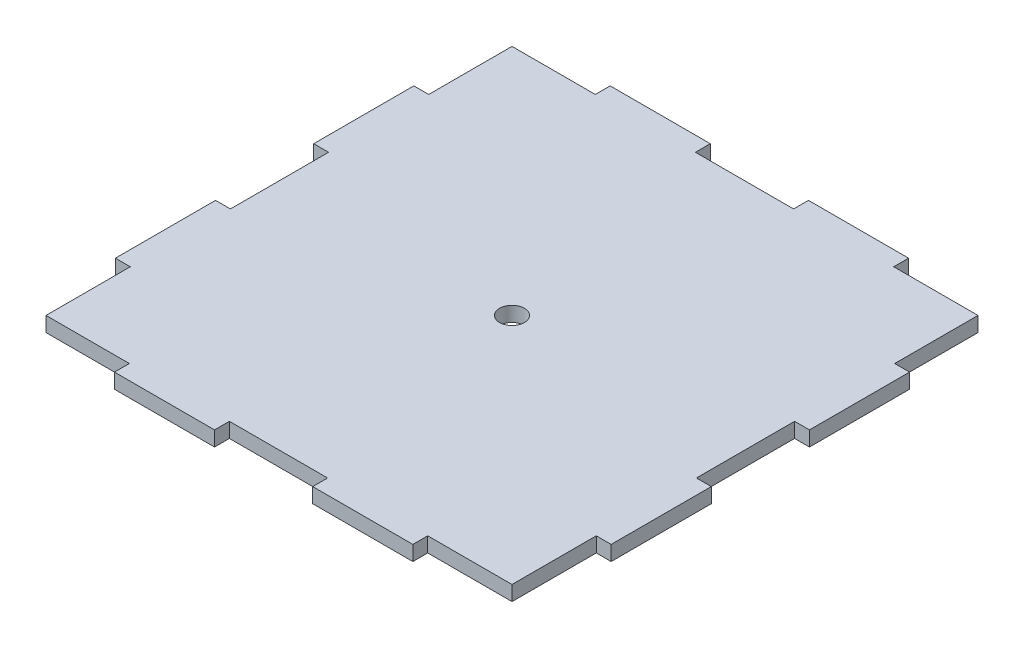
ISO-10303-21;
HEADER;
FILE_DESCRIPTION(('STEP AP214'),'2;1');
FILE_NAME('part.step','',(''),(''),'','','');
FILE_SCHEMA(('AUTOMOTIVE_DESIGN { 1 0 10303 214 1 1 1 1 }'));
ENDSEC;
DATA;
#1=APPLICATION_CONTEXT('core data for automotive mechanical design processes');
#2=APPLICATION_PROTOCOL_DEFINITION('international standard','automotive_design',2000,#1);
#3=PRODUCT_CONTEXT('',#1,'mechanical');
#4=PRODUCT('Part','Part','',(#3));
#5=PRODUCT_RELATED_PRODUCT_CATEGORY('part','',(#4));
#6=PRODUCT_DEFINITION_FORMATION('','',#4);
#7=PRODUCT_DEFINITION_CONTEXT('part definition',#1,'design');
#8=PRODUCT_DEFINITION('design','',#6,#7);
#9=PRODUCT_DEFINITION_SHAPE('','',#8);
#10=(LENGTH_UNIT() NAMED_UNIT(*) SI_UNIT(.MILLI.,.METRE.));
#11=(NAMED_UNIT(*) PLANE_ANGLE_UNIT() SI_UNIT($,.RADIAN.));
#12=(NAMED_UNIT(*) SI_UNIT($,.STERADIAN.) SOLID_ANGLE_UNIT());
#13=UNCERTAINTY_MEASURE_WITH_UNIT(LENGTH_MEASURE(1.E-05),#10,'distance_accuracy_value','');
#14=(GEOMETRIC_REPRESENTATION_CONTEXT(3) GLOBAL_UNCERTAINTY_ASSIGNED_CONTEXT((#13)) GLOBAL_UNIT_ASSIGNED_CONTEXT((#10,
#11,#12)) REPRESENTATION_CONTEXT('',''));
#15=CARTESIAN_POINT('',(0.,0.,0.));
#16=DIRECTION('',(0.,0.,1.));
#17=DIRECTION('',(1.,0.,0.));
#18=AXIS2_PLACEMENT_3D('',#15,#16,#17);
#19=CARTESIAN_POINT('',(97.0000000000006,3.,-6.79871422908079E-13));
#20=DIRECTION('',(1.,0.,0.));
#21=DIRECTION('',(0.,0.,-1.));
#22=AXIS2_PLACEMENT_3D('',#19,#20,#21);
#23=PLANE('',#22);
#24=DIRECTION('',(0.,0.,1.));
#25=VECTOR('',#24,1.);
#26=CARTESIAN_POINT('',(97.0000000000006,0.,-6.79871422908079E-13));
#27=LINE('',#26,#25);
#28=CARTESIAN_POINT('',(96.9999999999999,0.,-97.));
#29=VERTEX_POINT('',#28);
#30=CARTESIAN_POINT('',(97.,0.,-80.2000000000002));
#31=VERTEX_POINT('',#30);
#32=EDGE_CURVE('E389',#29,#31,#27,.T.);
#33=ORIENTED_EDGE('',*,*,#32,.F.);
#34=DIRECTION('',(0.,-1.,0.));
#35=VECTOR('',#34,1.);
#36=CARTESIAN_POINT('',(96.9999999999999,3.,-97.));
#37=LINE('',#36,#35);
#38=CARTESIAN_POINT('',(96.9999999999999,3.,-97.));
#39=VERTEX_POINT('',#38);
#40=EDGE_CURVE('E11',#39,#29,#37,.T.);
#41=ORIENTED_EDGE('',*,*,#40,.F.);
#42=DIRECTION('',(0.,0.,1.));
#43=VECTOR('',#42,1.);
#44=CARTESIAN_POINT('',(97.0000000000006,3.,-6.79871422908079E-13));
#45=LINE('',#44,#43);
#46=CARTESIAN_POINT('',(97.,3.,-80.2000000000002));
#47=VERTEX_POINT('',#46);
#48=EDGE_CURVE('E622',#39,#47,#45,.T.);
#49=ORIENTED_EDGE('',*,*,#48,.T.);
#50=DIRECTION('',(0.,-1.,0.));
#51=VECTOR('',#50,1.);
#52=CARTESIAN_POINT('',(97.,3.,-80.2000000000002));
#53=LINE('',#52,#51);
#54=EDGE_CURVE('E53',#47,#31,#53,.T.);
#55=ORIENTED_EDGE('',*,*,#54,.T.);
#56=EDGE_LOOP('',(#33,#41,#49,#55));
#57=FACE_BOUND('',#56,.T.);
#58=ADVANCED_FACE('F36',(#57),#23,.T.);
#59=CARTESIAN_POINT('',(0.,3.,-97.));
#60=DIRECTION('',(0.,0.,-1.));
#61=DIRECTION('',(-1.,0.,0.));
#62=AXIS2_PLACEMENT_3D('',#59,#60,#61);
#63=PLANE('',#62);
#64=DIRECTION('',(1.,0.,0.));
#65=VECTOR('',#64,1.);
#66=CARTESIAN_POINT('',(0.,0.,-97.));
#67=LINE('',#66,#65);
#68=CARTESIAN_POINT('',(79.9999999999999,0.,-97.));
#69=VERTEX_POINT('',#68);
#70=EDGE_CURVE('E383',#69,#29,#67,.T.);
#71=ORIENTED_EDGE('',*,*,#70,.F.);
#72=DIRECTION('',(0.,-1.,0.));
#73=VECTOR('',#72,1.);
#74=CARTESIAN_POINT('',(79.9999999999999,3.,-97.));
#75=LINE('',#74,#73);
#76=CARTESIAN_POINT('',(79.9999999999999,3.,-97.));
#77=VERTEX_POINT('',#76);
#78=EDGE_CURVE('E45',#77,#69,#75,.T.);
#79=ORIENTED_EDGE('',*,*,#78,.F.);
#80=DIRECTION('',(1.,0.,0.));
#81=VECTOR('',#80,1.);
#82=CARTESIAN_POINT('',(0.,3.,-97.));
#83=LINE('',#82,#81);
#84=EDGE_CURVE('E624',#77,#39,#83,.T.);
#85=ORIENTED_EDGE('',*,*,#84,.T.);
#86=ORIENTED_EDGE('',*,*,#40,.T.);
#87=EDGE_LOOP('',(#71,#79,#85,#86));
#88=FACE_BOUND('',#87,.T.);
#89=ADVANCED_FACE('F388',(#88),#63,.T.);
#90=CARTESIAN_POINT('',(79.9999999999999,3.,0.));
#91=DIRECTION('',(-1.,0.,0.));
#92=DIRECTION('',(0.,0.,1.));
#93=AXIS2_PLACEMENT_3D('',#90,#91,#92);
#94=PLANE('',#93);
#95=DIRECTION('',(0.,0.,-1.));
#96=VECTOR('',#95,1.);
#97=CARTESIAN_POINT('',(79.9999999999999,0.,0.));
#98=LINE('',#97,#96);
#99=CARTESIAN_POINT('',(79.9999999999999,0.,-100.));
#100=VERTEX_POINT('',#99);
#101=EDGE_CURVE('E373',#69,#100,#98,.T.);
#102=ORIENTED_EDGE('',*,*,#101,.T.);
#103=DIRECTION('',(0.,-1.,0.));
#104=VECTOR('',#103,1.);
#105=CARTESIAN_POINT('',(79.9999999999999,3.,-100.));
#106=LINE('',#105,#104);
#107=CARTESIAN_POINT('',(79.9999999999999,3.,-100.));
#108=VERTEX_POINT('',#107);
#109=EDGE_CURVE('E366',#108,#100,#106,.T.);
#110=ORIENTED_EDGE('',*,*,#109,.F.);
#111=DIRECTION('',(0.,0.,-1.));
#112=VECTOR('',#111,1.);
#113=CARTESIAN_POINT('',(79.9999999999999,3.,0.));
#114=LINE('',#113,#112);
#115=EDGE_CURVE('E375',#77,#108,#114,.T.);
#116=ORIENTED_EDGE('',*,*,#115,.F.);
#117=ORIENTED_EDGE('',*,*,#78,.T.);
#118=EDGE_LOOP('',(#102,#110,#116,#117));
#119=FACE_BOUND('',#118,.T.);
#120=ADVANCED_FACE('F371',(#119),#94,.F.);
#121=CARTESIAN_POINT('',(0.,3.,-100.));
#122=DIRECTION('',(0.,0.,-1.));
#123=DIRECTION('',(-1.,0.,0.));
#124=AXIS2_PLACEMENT_3D('',#121,#122,#123);
#125=PLANE('',#124);
#126=DIRECTION('',(1.,0.,0.));
#127=VECTOR('',#126,1.);
#128=CARTESIAN_POINT('',(0.,0.,-100.));
#129=LINE('',#128,#127);
#130=CARTESIAN_POINT('',(59.8,0.,-100.));
#131=VERTEX_POINT('',#130);
#132=EDGE_CURVE('E386',#131,#100,#129,.T.);
#133=ORIENTED_EDGE('',*,*,#132,.F.);
#134=DIRECTION('',(0.,-1.,0.));
#135=VECTOR('',#134,1.);
#136=CARTESIAN_POINT('',(59.8,3.,-100.));
#137=LINE('',#136,#135);
#138=CARTESIAN_POINT('',(59.8,3.,-100.));
#139=VERTEX_POINT('',#138);
#140=EDGE_CURVE('E364',#139,#131,#137,.T.);
#141=ORIENTED_EDGE('',*,*,#140,.F.);
#142=DIRECTION('',(1.,0.,0.));
#143=VECTOR('',#142,1.);
#144=CARTESIAN_POINT('',(0.,3.,-100.));
#145=LINE('',#144,#143);
#146=EDGE_CURVE('E629',#139,#108,#145,.T.);
#147=ORIENTED_EDGE('',*,*,#146,.T.);
#148=ORIENTED_EDGE('',*,*,#109,.T.);
#149=EDGE_LOOP('',(#133,#141,#147,#148));
#150=FACE_BOUND('',#149,.T.);
#151=ADVANCED_FACE('F506',(#150),#125,.T.);
#152=CARTESIAN_POINT('',(59.7999999999981,3.,1.1065222812097E-12));
#153=DIRECTION('',(-1.,0.,0.));
#154=DIRECTION('',(0.,0.,1.));
#155=AXIS2_PLACEMENT_3D('',#152,#153,#154);
#156=PLANE('',#155);
#157=DIRECTION('',(0.,0.,-1.));
#158=VECTOR('',#157,1.);
#159=CARTESIAN_POINT('',(59.7999999999981,0.,1.1065222812097E-12));
#160=LINE('',#159,#158);
#161=CARTESIAN_POINT('',(59.7999999999999,0.,-97.));
#162=VERTEX_POINT('',#161);
#163=EDGE_CURVE('E396',#162,#131,#160,.T.);
#164=ORIENTED_EDGE('',*,*,#163,.F.);
#165=DIRECTION('',(0.,-1.,0.));
#166=VECTOR('',#165,1.);
#167=CARTESIAN_POINT('',(59.7999999999999,3.,-97.));
#168=LINE('',#167,#166);
#169=CARTESIAN_POINT('',(59.7999999999999,3.,-97.));
#170=VERTEX_POINT('',#169);
#171=EDGE_CURVE('E362',#170,#162,#168,.T.);
#172=ORIENTED_EDGE('',*,*,#171,.F.);
#173=DIRECTION('',(0.,0.,-1.));
#174=VECTOR('',#173,1.);
#175=CARTESIAN_POINT('',(59.7999999999981,3.,1.1065222812097E-12));
#176=LINE('',#175,#174);
#177=EDGE_CURVE('E632',#170,#139,#176,.T.);
#178=ORIENTED_EDGE('',*,*,#177,.T.);
#179=ORIENTED_EDGE('',*,*,#140,.T.);
#180=EDGE_LOOP('',(#164,#172,#178,#179));
#181=FACE_BOUND('',#180,.T.);
#182=ADVANCED_FACE('F507',(#181),#156,.T.);
#183=CARTESIAN_POINT('',(0.,3.,-97.));
#184=DIRECTION('',(0.,0.,-1.));
#185=DIRECTION('',(-1.,0.,0.));
#186=AXIS2_PLACEMENT_3D('',#183,#184,#185);
#187=PLANE('',#186);
#188=DIRECTION('',(1.,0.,0.));
#189=VECTOR('',#188,1.);
#190=CARTESIAN_POINT('',(0.,0.,-97.));
#191=LINE('',#190,#189);
#192=CARTESIAN_POINT('',(39.9999999999999,0.,-97.));
#193=VERTEX_POINT('',#192);
#194=EDGE_CURVE('E399',#193,#162,#191,.T.);
#195=ORIENTED_EDGE('',*,*,#194,.F.);
#196=DIRECTION('',(0.,-1.,0.));
#197=VECTOR('',#196,1.);
#198=CARTESIAN_POINT('',(39.9999999999999,3.,-97.));
#199=LINE('',#198,#197);
#200=CARTESIAN_POINT('',(39.9999999999999,3.,-97.));
#201=VERTEX_POINT('',#200);
#202=EDGE_CURVE('E360',#201,#193,#199,.T.);
#203=ORIENTED_EDGE('',*,*,#202,.F.);
#204=DIRECTION('',(1.,0.,0.));
#205=VECTOR('',#204,1.);
#206=CARTESIAN_POINT('',(0.,3.,-97.));
#207=LINE('',#206,#205);
#208=EDGE_CURVE('E636',#201,#170,#207,.T.);
#209=ORIENTED_EDGE('',*,*,#208,.T.);
#210=ORIENTED_EDGE('',*,*,#171,.T.);
#211=EDGE_LOOP('',(#195,#203,#209,#210));
#212=FACE_BOUND('',#211,.T.);
#213=ADVANCED_FACE('F510',(#212),#187,.T.);
#214=CARTESIAN_POINT('',(39.9999999999999,3.,0.));
#215=DIRECTION('',(-1.,0.,0.));
#216=DIRECTION('',(0.,0.,1.));
#217=AXIS2_PLACEMENT_3D('',#214,#215,#216);
#218=PLANE('',#217);
#219=DIRECTION('',(0.,0.,-1.));
#220=VECTOR('',#219,1.);
#221=CARTESIAN_POINT('',(39.9999999999999,0.,0.));
#222=LINE('',#221,#220);
#223=CARTESIAN_POINT('',(39.9999999999999,0.,-100.));
#224=VERTEX_POINT('',#223);
#225=EDGE_CURVE('E402',#193,#224,#222,.T.);
#226=ORIENTED_EDGE('',*,*,#225,.T.);
#227=DIRECTION('',(0.,-1.,0.));
#228=VECTOR('',#227,1.);
#229=CARTESIAN_POINT('',(39.9999999999999,3.,-100.));
#230=LINE('',#229,#228);
#231=CARTESIAN_POINT('',(39.9999999999999,3.,-100.));
#232=VERTEX_POINT('',#231);
#233=EDGE_CURVE('E358',#232,#224,#230,.T.);
#234=ORIENTED_EDGE('',*,*,#233,.F.);
#235=DIRECTION('',(0.,0.,-1.));
#236=VECTOR('',#235,1.);
#237=CARTESIAN_POINT('',(39.9999999999999,3.,0.));
#238=LINE('',#237,#236);
#239=EDGE_CURVE('E639',#201,#232,#238,.T.);
#240=ORIENTED_EDGE('',*,*,#239,.F.);
#241=ORIENTED_EDGE('',*,*,#202,.T.);
#242=EDGE_LOOP('',(#226,#234,#240,#241));
#243=FACE_BOUND('',#242,.T.);
#244=ADVANCED_FACE('F514',(#243),#218,.F.);
#245=CARTESIAN_POINT('',(19.8,0.,-100.));
#246=VERTEX_POINT('',#245);
#247=EDGE_CURVE('E397',#246,#224,#129,.T.);
#248=ORIENTED_EDGE('',*,*,#247,.F.);
#249=DIRECTION('',(0.,-1.,0.));
#250=VECTOR('',#249,1.);
#251=CARTESIAN_POINT('',(19.8,3.,-100.));
#252=LINE('',#251,#250);
#253=CARTESIAN_POINT('',(19.8,3.,-100.));
#254=VERTEX_POINT('',#253);
#255=EDGE_CURVE('E356',#254,#246,#252,.T.);
#256=ORIENTED_EDGE('',*,*,#255,.F.);
#257=EDGE_CURVE('E633',#254,#232,#145,.T.);
#258=ORIENTED_EDGE('',*,*,#257,.T.);
#259=ORIENTED_EDGE('',*,*,#233,.T.);
#260=EDGE_LOOP('',(#248,#256,#258,#259));
#261=FACE_BOUND('',#260,.T.);
#262=ADVANCED_FACE('F518',(#261),#125,.T.);
#263=CARTESIAN_POINT('',(19.7999999999982,3.,3.66373598126267E-13));
#264=DIRECTION('',(-1.,0.,0.));
#265=DIRECTION('',(0.,0.,1.));
#266=AXIS2_PLACEMENT_3D('',#263,#264,#265);
#267=PLANE('',#266);
#268=DIRECTION('',(0.,0.,-1.));
#269=VECTOR('',#268,1.);
#270=CARTESIAN_POINT('',(19.7999999999982,0.,3.66373598126267E-13));
#271=LINE('',#270,#269);
#272=CARTESIAN_POINT('',(19.7999999999999,0.,-97.));
#273=VERTEX_POINT('',#272);
#274=EDGE_CURVE('E405',#273,#246,#271,.T.);
#275=ORIENTED_EDGE('',*,*,#274,.F.);
#276=DIRECTION('',(0.,-1.,0.));
#277=VECTOR('',#276,1.);
#278=CARTESIAN_POINT('',(19.7999999999999,3.,-97.));
#279=LINE('',#278,#277);
#280=CARTESIAN_POINT('',(19.7999999999999,3.,-97.));
#281=VERTEX_POINT('',#280);
#282=EDGE_CURVE('E354',#281,#273,#279,.T.);
#283=ORIENTED_EDGE('',*,*,#282,.F.);
#284=DIRECTION('',(0.,0.,-1.));
#285=VECTOR('',#284,1.);
#286=CARTESIAN_POINT('',(19.7999999999982,3.,3.66373598126267E-13));
#287=LINE('',#286,#285);
#288=EDGE_CURVE('E641',#281,#254,#287,.T.);
#289=ORIENTED_EDGE('',*,*,#288,.T.);
#290=ORIENTED_EDGE('',*,*,#255,.T.);
#291=EDGE_LOOP('',(#275,#283,#289,#290));
#292=FACE_BOUND('',#291,.T.);
#293=ADVANCED_FACE('F522',(#292),#267,.T.);
#294=CARTESIAN_POINT('',(0.,3.,-97.));
#295=DIRECTION('',(0.,0.,-1.));
#296=DIRECTION('',(-1.,0.,0.));
#297=AXIS2_PLACEMENT_3D('',#294,#295,#296);
#298=PLANE('',#297);
#299=DIRECTION('',(1.,0.,0.));
#300=VECTOR('',#299,1.);
#301=CARTESIAN_POINT('',(0.,0.,-97.));
#302=LINE('',#301,#300);
#303=CARTESIAN_POINT('',(3.,0.,-97.));
#304=VERTEX_POINT('',#303);
#305=EDGE_CURVE('E408',#304,#273,#302,.T.);
#306=ORIENTED_EDGE('',*,*,#305,.F.);
#307=DIRECTION('',(0.,-1.,0.));
#308=VECTOR('',#307,1.);
#309=CARTESIAN_POINT('',(3.,3.,-97.));
#310=LINE('',#309,#308);
#311=CARTESIAN_POINT('',(3.,3.,-97.));
#312=VERTEX_POINT('',#311);
#313=EDGE_CURVE('E352',#312,#304,#310,.T.);
#314=ORIENTED_EDGE('',*,*,#313,.F.);
#315=DIRECTION('',(1.,0.,0.));
#316=VECTOR('',#315,1.);
#317=CARTESIAN_POINT('',(0.,3.,-97.));
#318=LINE('',#317,#316);
#319=EDGE_CURVE('E644',#312,#281,#318,.T.);
#320=ORIENTED_EDGE('',*,*,#319,.T.);
#321=ORIENTED_EDGE('',*,*,#282,.T.);
#322=EDGE_LOOP('',(#306,#314,#320,#321));
#323=FACE_BOUND('',#322,.T.);
#324=ADVANCED_FACE('F526',(#323),#298,.T.);
#325=CARTESIAN_POINT('',(3.00000000000001,3.,0.));
#326=DIRECTION('',(1.,0.,0.));
#327=DIRECTION('',(0.,0.,-1.));
#328=AXIS2_PLACEMENT_3D('',#325,#326,#327);
#329=PLANE('',#328);
#330=DIRECTION('',(0.,0.,1.));
#331=VECTOR('',#330,1.);
#332=CARTESIAN_POINT('',(3.00000000000001,0.,0.));
#333=LINE('',#332,#331);
#334=CARTESIAN_POINT('',(3.,0.,-80.2));
#335=VERTEX_POINT('',#334);
#336=EDGE_CURVE('E411',#304,#335,#333,.T.);
#337=ORIENTED_EDGE('',*,*,#336,.T.);
#338=DIRECTION('',(0.,-1.,0.));
#339=VECTOR('',#338,1.);
#340=CARTESIAN_POINT('',(3.,3.,-80.2));
#341=LINE('',#340,#339);
#342=CARTESIAN_POINT('',(3.,3.,-80.2));
#343=VERTEX_POINT('',#342);
#344=EDGE_CURVE('E349',#343,#335,#341,.T.);
#345=ORIENTED_EDGE('',*,*,#344,.F.);
#346=DIRECTION('',(0.,0.,1.));
#347=VECTOR('',#346,1.);
#348=CARTESIAN_POINT('',(3.00000000000001,3.,0.));
#349=LINE('',#348,#347);
#350=EDGE_CURVE('E647',#312,#343,#349,.T.);
#351=ORIENTED_EDGE('',*,*,#350,.F.);
#352=ORIENTED_EDGE('',*,*,#313,.T.);
#353=EDGE_LOOP('',(#337,#345,#351,#352));
#354=FACE_BOUND('',#353,.T.);
#355=ADVANCED_FACE('F530',(#354),#329,.F.);
#356=CARTESIAN_POINT('',(0.,3.,-80.2));
#357=DIRECTION('',(0.,0.,1.));
#358=DIRECTION('',(1.,0.,0.));
#359=AXIS2_PLACEMENT_3D('',#356,#357,#358);
#360=PLANE('',#359);
#361=DIRECTION('',(-1.,0.,0.));
#362=VECTOR('',#361,1.);
#363=CARTESIAN_POINT('',(0.,0.,-80.2));
#364=LINE('',#363,#362);
#365=CARTESIAN_POINT('',(0.,0.,-80.2));
#366=VERTEX_POINT('',#365);
#367=EDGE_CURVE('E414',#335,#366,#364,.T.);
#368=ORIENTED_EDGE('',*,*,#367,.T.);
#369=DIRECTION('',(0.,-1.,0.));
#370=VECTOR('',#369,1.);
#371=CARTESIAN_POINT('',(0.,3.,-80.2));
#372=LINE('',#371,#370);
#373=CARTESIAN_POINT('',(0.,3.,-80.2));
#374=VERTEX_POINT('',#373);
#375=EDGE_CURVE('E347',#374,#366,#372,.T.);
#376=ORIENTED_EDGE('',*,*,#375,.F.);
#377=DIRECTION('',(-1.,0.,0.));
#378=VECTOR('',#377,1.);
#379=CARTESIAN_POINT('',(0.,3.,-80.2));
#380=LINE('',#379,#378);
#381=EDGE_CURVE('E650',#343,#374,#380,.T.);
#382=ORIENTED_EDGE('',*,*,#381,.F.);
#383=ORIENTED_EDGE('',*,*,#344,.T.);
#384=EDGE_LOOP('',(#368,#376,#382,#383));
#385=FACE_BOUND('',#384,.T.);
#386=ADVANCED_FACE('F534',(#385),#360,.F.);
#387=CARTESIAN_POINT('',(0.,3.,0.));
#388=DIRECTION('',(-1.,0.,0.));
#389=DIRECTION('',(0.,0.,1.));
#390=AXIS2_PLACEMENT_3D('',#387,#388,#389);
#391=PLANE('',#390);
#392=DIRECTION('',(0.,0.,-1.));
#393=VECTOR('',#392,1.);
#394=CARTESIAN_POINT('',(0.,0.,0.));
#395=LINE('',#394,#393);
#396=CARTESIAN_POINT('',(0.,0.,-60.));
#397=VERTEX_POINT('',#396);
#398=EDGE_CURVE('E417',#397,#366,#395,.T.);
#399=ORIENTED_EDGE('',*,*,#398,.F.);
#400=DIRECTION('',(0.,-1.,0.));
#401=VECTOR('',#400,1.);
#402=CARTESIAN_POINT('',(0.,3.,-60.));
#403=LINE('',#402,#401);
#404=CARTESIAN_POINT('',(0.,3.,-60.));
#405=VERTEX_POINT('',#404);
#406=EDGE_CURVE('E345',#405,#397,#403,.T.);
#407=ORIENTED_EDGE('',*,*,#406,.F.);
#408=DIRECTION('',(0.,0.,-1.));
#409=VECTOR('',#408,1.);
#410=CARTESIAN_POINT('',(0.,3.,0.));
#411=LINE('',#410,#409);
#412=EDGE_CURVE('E652',#405,#374,#411,.T.);
#413=ORIENTED_EDGE('',*,*,#412,.T.);
#414=ORIENTED_EDGE('',*,*,#375,.T.);
#415=EDGE_LOOP('',(#399,#407,#413,#414));
#416=FACE_BOUND('',#415,.T.);
#417=ADVANCED_FACE('F538',(#416),#391,.T.);
#418=CARTESIAN_POINT('',(0.,3.,-60.));
#419=DIRECTION('',(0.,0.,1.));
#420=DIRECTION('',(1.,0.,0.));
#421=AXIS2_PLACEMENT_3D('',#418,#419,#420);
#422=PLANE('',#421);
#423=DIRECTION('',(-1.,0.,0.));
#424=VECTOR('',#423,1.);
#425=CARTESIAN_POINT('',(0.,0.,-60.));
#426=LINE('',#425,#424);
#427=CARTESIAN_POINT('',(3.00000000000042,0.,-60.));
#428=VERTEX_POINT('',#427);
#429=EDGE_CURVE('E420',#428,#397,#426,.T.);
#430=ORIENTED_EDGE('',*,*,#429,.F.);
#431=DIRECTION('',(0.,-1.,0.));
#432=VECTOR('',#431,1.);
#433=CARTESIAN_POINT('',(3.00000000000042,3.,-60.));
#434=LINE('',#433,#432);
#435=CARTESIAN_POINT('',(3.00000000000042,3.,-60.));
#436=VERTEX_POINT('',#435);
#437=EDGE_CURVE('E343',#436,#428,#434,.T.);
#438=ORIENTED_EDGE('',*,*,#437,.F.);
#439=DIRECTION('',(-1.,0.,0.));
#440=VECTOR('',#439,1.);
#441=CARTESIAN_POINT('',(0.,3.,-60.));
#442=LINE('',#441,#440);
#443=EDGE_CURVE('E655',#436,#405,#442,.T.);
#444=ORIENTED_EDGE('',*,*,#443,.T.);
#445=ORIENTED_EDGE('',*,*,#406,.T.);
#446=EDGE_LOOP('',(#430,#438,#444,#445));
#447=FACE_BOUND('',#446,.T.);
#448=ADVANCED_FACE('F540',(#447),#422,.T.);
#449=CARTESIAN_POINT('',(3.00000000000043,3.,0.));
#450=DIRECTION('',(1.,0.,0.));
#451=DIRECTION('',(0.,0.,-1.));
#452=AXIS2_PLACEMENT_3D('',#449,#450,#451);
#453=PLANE('',#452);
#454=DIRECTION('',(0.,0.,1.));
#455=VECTOR('',#454,1.);
#456=CARTESIAN_POINT('',(3.00000000000043,0.,0.));
#457=LINE('',#456,#455);
#458=CARTESIAN_POINT('',(3.00000000000042,0.,-40.2));
#459=VERTEX_POINT('',#458);
#460=EDGE_CURVE('E424',#428,#459,#457,.T.);
#461=ORIENTED_EDGE('',*,*,#460,.T.);
#462=DIRECTION('',(0.,-1.,0.));
#463=VECTOR('',#462,1.);
#464=CARTESIAN_POINT('',(3.00000000000042,3.,-40.2));
#465=LINE('',#464,#463);
#466=CARTESIAN_POINT('',(3.00000000000042,3.,-40.2));
#467=VERTEX_POINT('',#466);
#468=EDGE_CURVE('E340',#467,#459,#465,.T.);
#469=ORIENTED_EDGE('',*,*,#468,.F.);
#470=DIRECTION('',(0.,0.,1.));
#471=VECTOR('',#470,1.);
#472=CARTESIAN_POINT('',(3.00000000000043,3.,0.));
#473=LINE('',#472,#471);
#474=EDGE_CURVE('E659',#436,#467,#473,.T.);
#475=ORIENTED_EDGE('',*,*,#474,.F.);
#476=ORIENTED_EDGE('',*,*,#437,.T.);
#477=EDGE_LOOP('',(#461,#469,#475,#476));
#478=FACE_BOUND('',#477,.T.);
#479=ADVANCED_FACE('F543',(#478),#453,.F.);
#480=CARTESIAN_POINT('',(0.,3.,-40.2));
#481=DIRECTION('',(0.,0.,1.));
#482=DIRECTION('',(1.,0.,0.));
#483=AXIS2_PLACEMENT_3D('',#480,#481,#482);
#484=PLANE('',#483);
#485=DIRECTION('',(-1.,0.,0.));
#486=VECTOR('',#485,1.);
#487=CARTESIAN_POINT('',(0.,0.,-40.2));
#488=LINE('',#487,#486);
#489=CARTESIAN_POINT('',(0.,0.,-40.2));
#490=VERTEX_POINT('',#489);
#491=EDGE_CURVE('E427',#459,#490,#488,.T.);
#492=ORIENTED_EDGE('',*,*,#491,.T.);
#493=DIRECTION('',(0.,-1.,0.));
#494=VECTOR('',#493,1.);
#495=CARTESIAN_POINT('',(0.,3.,-40.2));
#496=LINE('',#495,#494);
#497=CARTESIAN_POINT('',(0.,3.,-40.2));
#498=VERTEX_POINT('',#497);
#499=EDGE_CURVE('E338',#498,#490,#496,.T.);
#500=ORIENTED_EDGE('',*,*,#499,.F.);
#501=DIRECTION('',(-1.,0.,0.));
#502=VECTOR('',#501,1.);
#503=CARTESIAN_POINT('',(0.,3.,-40.2));
#504=LINE('',#503,#502);
#505=EDGE_CURVE('E662',#467,#498,#504,.T.);
#506=ORIENTED_EDGE('',*,*,#505,.F.);
#507=ORIENTED_EDGE('',*,*,#468,.T.);
#508=EDGE_LOOP('',(#492,#500,#506,#507));
#509=FACE_BOUND('',#508,.T.);
#510=ADVANCED_FACE('F547',(#509),#484,.F.);
#511=CARTESIAN_POINT('',(0.,0.,-20.));
#512=VERTEX_POINT('',#511);
#513=EDGE_CURVE('E421',#512,#490,#395,.T.);
#514=ORIENTED_EDGE('',*,*,#513,.F.);
#515=DIRECTION('',(0.,-1.,0.));
#516=VECTOR('',#515,1.);
#517=CARTESIAN_POINT('',(0.,3.,-20.));
#518=LINE('',#517,#516);
#519=CARTESIAN_POINT('',(0.,3.,-20.));
#520=VERTEX_POINT('',#519);
#521=EDGE_CURVE('E336',#520,#512,#518,.T.);
#522=ORIENTED_EDGE('',*,*,#521,.F.);
#523=EDGE_CURVE('E656',#520,#498,#411,.T.);
#524=ORIENTED_EDGE('',*,*,#523,.T.);
#525=ORIENTED_EDGE('',*,*,#499,.T.);
#526=EDGE_LOOP('',(#514,#522,#524,#525));
#527=FACE_BOUND('',#526,.T.);
#528=ADVANCED_FACE('F551',(#527),#391,.T.);
#529=CARTESIAN_POINT('',(0.,3.,-20.));
#530=DIRECTION('',(0.,0.,1.));
#531=DIRECTION('',(1.,0.,0.));
#532=AXIS2_PLACEMENT_3D('',#529,#530,#531);
#533=PLANE('',#532);
#534=DIRECTION('',(-1.,0.,0.));
#535=VECTOR('',#534,1.);
#536=CARTESIAN_POINT('',(0.,0.,-20.));
#537=LINE('',#536,#535);
#538=CARTESIAN_POINT('',(3.00000000000084,0.,-20.));
#539=VERTEX_POINT('',#538);
#540=EDGE_CURVE('E430',#539,#512,#537,.T.);
#541=ORIENTED_EDGE('',*,*,#540,.F.);
#542=DIRECTION('',(0.,-1.,0.));
#543=VECTOR('',#542,1.);
#544=CARTESIAN_POINT('',(3.00000000000084,3.,-20.));
#545=LINE('',#544,#543);
#546=CARTESIAN_POINT('',(3.00000000000084,3.,-20.));
#547=VERTEX_POINT('',#546);
#548=EDGE_CURVE('E334',#547,#539,#545,.T.);
#549=ORIENTED_EDGE('',*,*,#548,.F.);
#550=DIRECTION('',(-1.,0.,0.));
#551=VECTOR('',#550,1.);
#552=CARTESIAN_POINT('',(0.,3.,-20.));
#553=LINE('',#552,#551);
#554=EDGE_CURVE('E664',#547,#520,#553,.T.);
#555=ORIENTED_EDGE('',*,*,#554,.T.);
#556=ORIENTED_EDGE('',*,*,#521,.T.);
#557=EDGE_LOOP('',(#541,#549,#555,#556));
#558=FACE_BOUND('',#557,.T.);
#559=ADVANCED_FACE('F555',(#558),#533,.T.);
#560=CARTESIAN_POINT('',(3.00000000000084,3.,0.));
#561=DIRECTION('',(1.,0.,0.));
#562=DIRECTION('',(0.,0.,-1.));
#563=AXIS2_PLACEMENT_3D('',#560,#561,#562);
#564=PLANE('',#563);
#565=DIRECTION('',(0.,0.,1.));
#566=VECTOR('',#565,1.);
#567=CARTESIAN_POINT('',(3.00000000000084,0.,0.));
#568=LINE('',#567,#566);
#569=CARTESIAN_POINT('',(3.00000000000084,0.,-3.));
#570=VERTEX_POINT('',#569);
#571=EDGE_CURVE('E433',#539,#570,#568,.T.);
#572=ORIENTED_EDGE('',*,*,#571,.T.);
#573=DIRECTION('',(0.,-1.,0.));
#574=VECTOR('',#573,1.);
#575=CARTESIAN_POINT('',(3.00000000000084,3.,-3.));
#576=LINE('',#575,#574);
#577=CARTESIAN_POINT('',(3.00000000000084,3.,-3.));
#578=VERTEX_POINT('',#577);
#579=EDGE_CURVE('E331',#578,#570,#576,.T.);
#580=ORIENTED_EDGE('',*,*,#579,.F.);
#581=DIRECTION('',(0.,0.,1.));
#582=VECTOR('',#581,1.);
#583=CARTESIAN_POINT('',(3.00000000000084,3.,0.));
#584=LINE('',#583,#582);
#585=EDGE_CURVE('E667',#547,#578,#584,.T.);
#586=ORIENTED_EDGE('',*,*,#585,.F.);
#587=ORIENTED_EDGE('',*,*,#548,.T.);
#588=EDGE_LOOP('',(#572,#580,#586,#587));
#589=FACE_BOUND('',#588,.T.);
#590=ADVANCED_FACE('F559',(#589),#564,.F.);
#591=CARTESIAN_POINT('',(0.,3.,-3.));
#592=DIRECTION('',(0.,0.,-1.));
#593=DIRECTION('',(-1.,0.,0.));
#594=AXIS2_PLACEMENT_3D('',#591,#592,#593);
#595=PLANE('',#594);
#596=DIRECTION('',(1.,0.,0.));
#597=VECTOR('',#596,1.);
#598=CARTESIAN_POINT('',(0.,0.,-3.));
#599=LINE('',#598,#597);
#600=CARTESIAN_POINT('',(19.7999999999999,0.,-3.));
#601=VERTEX_POINT('',#600);
#602=EDGE_CURVE('E436',#570,#601,#599,.T.);
#603=ORIENTED_EDGE('',*,*,#602,.T.);
#604=DIRECTION('',(0.,-1.,0.));
#605=VECTOR('',#604,1.);
#606=CARTESIAN_POINT('',(19.7999999999999,3.,-3.));
#607=LINE('',#606,#605);
#608=CARTESIAN_POINT('',(19.7999999999999,3.,-3.));
#609=VERTEX_POINT('',#608);
#610=EDGE_CURVE('E328',#609,#601,#607,.T.);
#611=ORIENTED_EDGE('',*,*,#610,.F.);
#612=DIRECTION('',(1.,0.,0.));
#613=VECTOR('',#612,1.);
#614=CARTESIAN_POINT('',(0.,3.,-3.));
#615=LINE('',#614,#613);
#616=EDGE_CURVE('E670',#578,#609,#615,.T.);
#617=ORIENTED_EDGE('',*,*,#616,.F.);
#618=ORIENTED_EDGE('',*,*,#579,.T.);
#619=EDGE_LOOP('',(#603,#611,#617,#618));
#620=FACE_BOUND('',#619,.T.);
#621=ADVANCED_FACE('F563',(#620),#595,.F.);
#622=CARTESIAN_POINT('',(19.8,3.,-3.66373598126301E-13));
#623=DIRECTION('',(1.,0.,0.));
#624=DIRECTION('',(0.,0.,-1.));
#625=AXIS2_PLACEMENT_3D('',#622,#623,#624);
#626=PLANE('',#625);
#627=DIRECTION('',(0.,0.,1.));
#628=VECTOR('',#627,1.);
#629=CARTESIAN_POINT('',(19.8,0.,-3.66373598126301E-13));
#630=LINE('',#629,#628);
#631=CARTESIAN_POINT('',(19.8,0.,0.));
#632=VERTEX_POINT('',#631);
#633=EDGE_CURVE('E439',#601,#632,#630,.T.);
#634=ORIENTED_EDGE('',*,*,#633,.T.);
#635=DIRECTION('',(0.,-1.,0.));
#636=VECTOR('',#635,1.);
#637=CARTESIAN_POINT('',(19.8,3.,0.));
#638=LINE('',#637,#636);
#639=CARTESIAN_POINT('',(19.8,3.,0.));
#640=VERTEX_POINT('',#639);
#641=EDGE_CURVE('E325',#640,#632,#638,.T.);
#642=ORIENTED_EDGE('',*,*,#641,.F.);
#643=DIRECTION('',(0.,0.,1.));
#644=VECTOR('',#643,1.);
#645=CARTESIAN_POINT('',(19.8,3.,-3.66373598126301E-13));
#646=LINE('',#645,#644);
#647=EDGE_CURVE('E673',#609,#640,#646,.T.);
#648=ORIENTED_EDGE('',*,*,#647,.F.);
#649=ORIENTED_EDGE('',*,*,#610,.T.);
#650=EDGE_LOOP('',(#634,#642,#648,#649));
#651=FACE_BOUND('',#650,.T.);
#652=ADVANCED_FACE('F567',(#651),#626,.F.);
#653=CARTESIAN_POINT('',(0.,3.,0.));
#654=DIRECTION('',(0.,0.,-1.));
#655=DIRECTION('',(-1.,0.,0.));
#656=AXIS2_PLACEMENT_3D('',#653,#654,#655);
#657=PLANE('',#656);
#658=DIRECTION('',(1.,0.,0.));
#659=VECTOR('',#658,1.);
#660=CARTESIAN_POINT('',(0.,0.,0.));
#661=LINE('',#660,#659);
#662=CARTESIAN_POINT('',(39.9999999999999,0.,0.));
#663=VERTEX_POINT('',#662);
#664=EDGE_CURVE('E442',#632,#663,#661,.T.);
#665=ORIENTED_EDGE('',*,*,#664,.T.);
#666=DIRECTION('',(0.,-1.,0.));
#667=VECTOR('',#666,1.);
#668=CARTESIAN_POINT('',(39.9999999999999,3.,0.));
#669=LINE('',#668,#667);
#670=CARTESIAN_POINT('',(39.9999999999999,3.,0.));
#671=VERTEX_POINT('',#670);
#672=EDGE_CURVE('E323',#671,#663,#669,.T.);
#673=ORIENTED_EDGE('',*,*,#672,.F.);
#674=DIRECTION('',(1.,0.,0.));
#675=VECTOR('',#674,1.);
#676=CARTESIAN_POINT('',(0.,3.,0.));
#677=LINE('',#676,#675);
#678=EDGE_CURVE('E676',#640,#671,#677,.T.);
#679=ORIENTED_EDGE('',*,*,#678,.F.);
#680=ORIENTED_EDGE('',*,*,#641,.T.);
#681=EDGE_LOOP('',(#665,#673,#679,#680));
#682=FACE_BOUND('',#681,.T.);
#683=ADVANCED_FACE('F571',(#682),#657,.F.);
#684=CARTESIAN_POINT('',(39.9999999999999,3.,0.));
#685=DIRECTION('',(1.,0.,0.));
#686=DIRECTION('',(0.,0.,-1.));
#687=AXIS2_PLACEMENT_3D('',#684,#685,#686);
#688=PLANE('',#687);
#689=DIRECTION('',(0.,0.,1.));
#690=VECTOR('',#689,1.);
#691=CARTESIAN_POINT('',(39.9999999999999,0.,0.));
#692=LINE('',#691,#690);
#693=CARTESIAN_POINT('',(39.9999999999999,0.,-3.));
#694=VERTEX_POINT('',#693);
#695=EDGE_CURVE('E445',#694,#663,#692,.T.);
#696=ORIENTED_EDGE('',*,*,#695,.F.);
#697=DIRECTION('',(0.,-1.,0.));
#698=VECTOR('',#697,1.);
#699=CARTESIAN_POINT('',(39.9999999999999,3.,-3.));
#700=LINE('',#699,#698);
#701=CARTESIAN_POINT('',(39.9999999999999,3.,-3.));
#702=VERTEX_POINT('',#701);
#703=EDGE_CURVE('E321',#702,#694,#700,.T.);
#704=ORIENTED_EDGE('',*,*,#703,.F.);
#705=DIRECTION('',(0.,0.,1.));
#706=VECTOR('',#705,1.);
#707=CARTESIAN_POINT('',(39.9999999999999,3.,0.));
#708=LINE('',#707,#706);
#709=EDGE_CURVE('E678',#702,#671,#708,.T.);
#710=ORIENTED_EDGE('',*,*,#709,.T.);
#711=ORIENTED_EDGE('',*,*,#672,.T.);
#712=EDGE_LOOP('',(#696,#704,#710,#711));
#713=FACE_BOUND('',#712,.T.);
#714=ADVANCED_FACE('F573',(#713),#688,.T.);
#715=CARTESIAN_POINT('',(0.,3.,-3.));
#716=DIRECTION('',(0.,0.,-1.));
#717=DIRECTION('',(-1.,0.,0.));
#718=AXIS2_PLACEMENT_3D('',#715,#716,#717);
#719=PLANE('',#718);
#720=DIRECTION('',(1.,0.,0.));
#721=VECTOR('',#720,1.);
#722=CARTESIAN_POINT('',(0.,0.,-3.));
#723=LINE('',#722,#721);
#724=CARTESIAN_POINT('',(59.7999999999999,0.,-3.));
#725=VERTEX_POINT('',#724);
#726=EDGE_CURVE('E449',#694,#725,#723,.T.);
#727=ORIENTED_EDGE('',*,*,#726,.T.);
#728=DIRECTION('',(0.,-1.,0.));
#729=VECTOR('',#728,1.);
#730=CARTESIAN_POINT('',(59.7999999999999,3.,-3.));
#731=LINE('',#730,#729);
#732=CARTESIAN_POINT('',(59.7999999999999,3.,-3.));
#733=VERTEX_POINT('',#732);
#734=EDGE_CURVE('E318',#733,#725,#731,.T.);
#735=ORIENTED_EDGE('',*,*,#734,.F.);
#736=DIRECTION('',(1.,0.,0.));
#737=VECTOR('',#736,1.);
#738=CARTESIAN_POINT('',(0.,3.,-3.));
#739=LINE('',#738,#737);
#740=EDGE_CURVE('E682',#702,#733,#739,.T.);
#741=ORIENTED_EDGE('',*,*,#740,.F.);
#742=ORIENTED_EDGE('',*,*,#703,.T.);
#743=EDGE_LOOP('',(#727,#735,#741,#742));
#744=FACE_BOUND('',#743,.T.);
#745=ADVANCED_FACE('F576',(#744),#719,.F.);
#746=CARTESIAN_POINT('',(59.8,3.,-1.10652228120974E-12));
#747=DIRECTION('',(1.,0.,0.));
#748=DIRECTION('',(0.,0.,-1.));
#749=AXIS2_PLACEMENT_3D('',#746,#747,#748);
#750=PLANE('',#749);
#751=DIRECTION('',(0.,0.,1.));
#752=VECTOR('',#751,1.);
#753=CARTESIAN_POINT('',(59.8,0.,-1.10652228120974E-12));
#754=LINE('',#753,#752);
#755=CARTESIAN_POINT('',(59.8,0.,0.));
#756=VERTEX_POINT('',#755);
#757=EDGE_CURVE('E452',#725,#756,#754,.T.);
#758=ORIENTED_EDGE('',*,*,#757,.T.);
#759=DIRECTION('',(0.,-1.,0.));
#760=VECTOR('',#759,1.);
#761=CARTESIAN_POINT('',(59.8,3.,0.));
#762=LINE('',#761,#760);
#763=CARTESIAN_POINT('',(59.8,3.,0.));
#764=VERTEX_POINT('',#763);
#765=EDGE_CURVE('E315',#764,#756,#762,.T.);
#766=ORIENTED_EDGE('',*,*,#765,.F.);
#767=DIRECTION('',(0.,0.,1.));
#768=VECTOR('',#767,1.);
#769=CARTESIAN_POINT('',(59.8,3.,-1.10652228120974E-12));
#770=LINE('',#769,#768);
#771=EDGE_CURVE('E685',#733,#764,#770,.T.);
#772=ORIENTED_EDGE('',*,*,#771,.F.);
#773=ORIENTED_EDGE('',*,*,#734,.T.);
#774=EDGE_LOOP('',(#758,#766,#772,#773));
#775=FACE_BOUND('',#774,.T.);
#776=ADVANCED_FACE('F580',(#775),#750,.F.);
#777=CARTESIAN_POINT('',(79.9999999999999,0.,0.));
#778=VERTEX_POINT('',#777);
#779=EDGE_CURVE('E446',#756,#778,#661,.T.);
#780=ORIENTED_EDGE('',*,*,#779,.T.);
#781=DIRECTION('',(0.,-1.,0.));
#782=VECTOR('',#781,1.);
#783=CARTESIAN_POINT('',(79.9999999999999,3.,0.));
#784=LINE('',#783,#782);
#785=CARTESIAN_POINT('',(79.9999999999999,3.,0.));
#786=VERTEX_POINT('',#785);
#787=EDGE_CURVE('E313',#786,#778,#784,.T.);
#788=ORIENTED_EDGE('',*,*,#787,.F.);
#789=EDGE_CURVE('E679',#764,#786,#677,.T.);
#790=ORIENTED_EDGE('',*,*,#789,.F.);
#791=ORIENTED_EDGE('',*,*,#765,.T.);
#792=EDGE_LOOP('',(#780,#788,#790,#791));
#793=FACE_BOUND('',#792,.T.);
#794=ADVANCED_FACE('F584',(#793),#657,.F.);
#795=CARTESIAN_POINT('',(79.9999999999999,3.,0.));
#796=DIRECTION('',(1.,0.,0.));
#797=DIRECTION('',(0.,0.,-1.));
#798=AXIS2_PLACEMENT_3D('',#795,#796,#797);
#799=PLANE('',#798);
#800=DIRECTION('',(0.,0.,1.));
#801=VECTOR('',#800,1.);
#802=CARTESIAN_POINT('',(79.9999999999999,0.,0.));
#803=LINE('',#802,#801);
#804=CARTESIAN_POINT('',(79.9999999999999,0.,-3.));
#805=VERTEX_POINT('',#804);
#806=EDGE_CURVE('E455',#805,#778,#803,.T.);
#807=ORIENTED_EDGE('',*,*,#806,.F.);
#808=DIRECTION('',(0.,-1.,0.));
#809=VECTOR('',#808,1.);
#810=CARTESIAN_POINT('',(79.9999999999999,3.,-3.));
#811=LINE('',#810,#809);
#812=CARTESIAN_POINT('',(79.9999999999999,3.,-3.));
#813=VERTEX_POINT('',#812);
#814=EDGE_CURVE('E311',#813,#805,#811,.T.);
#815=ORIENTED_EDGE('',*,*,#814,.F.);
#816=DIRECTION('',(0.,0.,1.));
#817=VECTOR('',#816,1.);
#818=CARTESIAN_POINT('',(79.9999999999999,3.,0.));
#819=LINE('',#818,#817);
#820=EDGE_CURVE('E688',#813,#786,#819,.T.);
#821=ORIENTED_EDGE('',*,*,#820,.T.);
#822=ORIENTED_EDGE('',*,*,#787,.T.);
#823=EDGE_LOOP('',(#807,#815,#821,#822));
#824=FACE_BOUND('',#823,.T.);
#825=ADVANCED_FACE('F588',(#824),#799,.T.);
#826=CARTESIAN_POINT('',(0.,3.,-3.));
#827=DIRECTION('',(0.,0.,-1.));
#828=DIRECTION('',(-1.,0.,0.));
#829=AXIS2_PLACEMENT_3D('',#826,#827,#828);
#830=PLANE('',#829);
#831=DIRECTION('',(1.,0.,0.));
#832=VECTOR('',#831,1.);
#833=CARTESIAN_POINT('',(0.,0.,-3.));
#834=LINE('',#833,#832);
#835=CARTESIAN_POINT('',(96.9999999999998,0.,-3.));
#836=VERTEX_POINT('',#835);
#837=EDGE_CURVE('E458',#805,#836,#834,.T.);
#838=ORIENTED_EDGE('',*,*,#837,.T.);
#839=DIRECTION('',(0.,-1.,0.));
#840=VECTOR('',#839,1.);
#841=CARTESIAN_POINT('',(96.9999999999998,3.,-3.));
#842=LINE('',#841,#840);
#843=CARTESIAN_POINT('',(96.9999999999998,3.,-3.));
#844=VERTEX_POINT('',#843);
#845=EDGE_CURVE('E309',#844,#836,#842,.T.);
#846=ORIENTED_EDGE('',*,*,#845,.F.);
#847=DIRECTION('',(1.,0.,0.));
#848=VECTOR('',#847,1.);
#849=CARTESIAN_POINT('',(0.,3.,-3.));
#850=LINE('',#849,#848);
#851=EDGE_CURVE('E691',#813,#844,#850,.T.);
#852=ORIENTED_EDGE('',*,*,#851,.F.);
#853=ORIENTED_EDGE('',*,*,#814,.T.);
#854=EDGE_LOOP('',(#838,#846,#852,#853));
#855=FACE_BOUND('',#854,.T.);
#856=ADVANCED_FACE('F592',(#855),#830,.F.);
#857=CARTESIAN_POINT('',(96.9999999999998,3.,-6.11884280617272E-13));
#858=DIRECTION('',(1.,0.,0.));
#859=DIRECTION('',(0.,0.,-1.));
#860=AXIS2_PLACEMENT_3D('',#857,#858,#859);
#861=PLANE('',#860);
#862=DIRECTION('',(0.,0.,1.));
#863=VECTOR('',#862,1.);
#864=CARTESIAN_POINT('',(96.9999999999998,0.,-6.11884280617272E-13));
#865=LINE('',#864,#863);
#866=CARTESIAN_POINT('',(96.9999999999996,0.,-20.0000000000002));
#867=VERTEX_POINT('',#866);
#868=EDGE_CURVE('E461',#867,#836,#865,.T.);
#869=ORIENTED_EDGE('',*,*,#868,.F.);
#870=DIRECTION('',(0.,-1.,0.));
#871=VECTOR('',#870,1.);
#872=CARTESIAN_POINT('',(96.9999999999996,3.,-20.0000000000002));
#873=LINE('',#872,#871);
#874=CARTESIAN_POINT('',(96.9999999999996,3.,-20.0000000000002));
#875=VERTEX_POINT('',#874);
#876=EDGE_CURVE('E307',#875,#867,#873,.T.);
#877=ORIENTED_EDGE('',*,*,#876,.F.);
#878=DIRECTION('',(0.,0.,1.));
#879=VECTOR('',#878,1.);
#880=CARTESIAN_POINT('',(96.9999999999998,3.,-6.11884280617272E-13));
#881=LINE('',#880,#879);
#882=EDGE_CURVE('E693',#875,#844,#881,.T.);
#883=ORIENTED_EDGE('',*,*,#882,.T.);
#884=ORIENTED_EDGE('',*,*,#845,.T.);
#885=EDGE_LOOP('',(#869,#877,#883,#884));
#886=FACE_BOUND('',#885,.T.);
#887=ADVANCED_FACE('F596',(#886),#861,.T.);
#888=CARTESIAN_POINT('',(-1.48029736616634E-12,3.,-19.999999999993));
#889=DIRECTION('',(0.,0.,-1.));
#890=DIRECTION('',(-1.,0.,0.));
#891=AXIS2_PLACEMENT_3D('',#888,#889,#890);
#892=PLANE('',#891);
#893=DIRECTION('',(1.,0.,0.));
#894=VECTOR('',#893,1.);
#895=CARTESIAN_POINT('',(-1.48029736616634E-12,0.,-19.999999999993));
#896=LINE('',#895,#894);
#897=CARTESIAN_POINT('',(100.,0.,-20.0000000000003));
#898=VERTEX_POINT('',#897);
#899=EDGE_CURVE('E464',#867,#898,#896,.T.);
#900=ORIENTED_EDGE('',*,*,#899,.T.);
#901=DIRECTION('',(0.,-1.,0.));
#902=VECTOR('',#901,1.);
#903=CARTESIAN_POINT('',(100.,3.,-20.0000000000003));
#904=LINE('',#903,#902);
#905=CARTESIAN_POINT('',(100.,3.,-20.0000000000003));
#906=VERTEX_POINT('',#905);
#907=EDGE_CURVE('E304',#906,#898,#904,.T.);
#908=ORIENTED_EDGE('',*,*,#907,.F.);
#909=DIRECTION('',(1.,0.,0.));
#910=VECTOR('',#909,1.);
#911=CARTESIAN_POINT('',(-1.48029736616634E-12,3.,-19.999999999993));
#912=LINE('',#911,#910);
#913=EDGE_CURVE('E696',#875,#906,#912,.T.);
#914=ORIENTED_EDGE('',*,*,#913,.F.);
#915=ORIENTED_EDGE('',*,*,#876,.T.);
#916=EDGE_LOOP('',(#900,#908,#914,#915));
#917=FACE_BOUND('',#916,.T.);
#918=ADVANCED_FACE('F600',(#917),#892,.F.);
#919=CARTESIAN_POINT('',(100.,3.,0.));
#920=DIRECTION('',(-1.,0.,0.));
#921=DIRECTION('',(0.,0.,1.));
#922=AXIS2_PLACEMENT_3D('',#919,#920,#921);
#923=PLANE('',#922);
#924=DIRECTION('',(0.,0.,-1.));
#925=VECTOR('',#924,1.);
#926=CARTESIAN_POINT('',(100.,0.,0.));
#927=LINE('',#926,#925);
#928=CARTESIAN_POINT('',(100.,0.,-40.2000000000005));
#929=VERTEX_POINT('',#928);
#930=EDGE_CURVE('E467',#898,#929,#927,.T.);
#931=ORIENTED_EDGE('',*,*,#930,.T.);
#932=DIRECTION('',(0.,-1.,0.));
#933=VECTOR('',#932,1.);
#934=CARTESIAN_POINT('',(100.,3.,-40.2000000000005));
#935=LINE('',#934,#933);
#936=CARTESIAN_POINT('',(100.,3.,-40.2000000000005));
#937=VERTEX_POINT('',#936);
#938=EDGE_CURVE('E302',#937,#929,#935,.T.);
#939=ORIENTED_EDGE('',*,*,#938,.F.);
#940=DIRECTION('',(0.,0.,-1.));
#941=VECTOR('',#940,1.);
#942=CARTESIAN_POINT('',(100.,3.,0.));
#943=LINE('',#942,#941);
#944=EDGE_CURVE('E282',#906,#937,#943,.T.);
#945=ORIENTED_EDGE('',*,*,#944,.F.);
#946=ORIENTED_EDGE('',*,*,#907,.T.);
#947=EDGE_LOOP('',(#931,#939,#945,#946));
#948=FACE_BOUND('',#947,.T.);
#949=ADVANCED_FACE('F496',(#948),#923,.F.);
#950=CARTESIAN_POINT('',(-2.97539770599492E-12,3.,-40.199999999993));
#951=DIRECTION('',(0.,0.,-1.));
#952=DIRECTION('',(-1.,0.,0.));
#953=AXIS2_PLACEMENT_3D('',#950,#951,#952);
#954=PLANE('',#953);
#955=DIRECTION('',(1.,0.,0.));
#956=VECTOR('',#955,1.);
#957=CARTESIAN_POINT('',(-2.97539770599492E-12,0.,-40.199999999993));
#958=LINE('',#957,#956);
#959=CARTESIAN_POINT('',(96.9999999999999,0.,-40.2000000000002));
#960=VERTEX_POINT('',#959);
#961=EDGE_CURVE('E470',#960,#929,#958,.T.);
#962=ORIENTED_EDGE('',*,*,#961,.F.);
#963=DIRECTION('',(0.,-1.,0.));
#964=VECTOR('',#963,1.);
#965=CARTESIAN_POINT('',(96.9999999999999,3.,-40.2000000000002));
#966=LINE('',#965,#964);
#967=CARTESIAN_POINT('',(96.9999999999999,3.,-40.2000000000002));
#968=VERTEX_POINT('',#967);
#969=EDGE_CURVE('E296',#968,#960,#966,.T.);
#970=ORIENTED_EDGE('',*,*,#969,.F.);
#971=DIRECTION('',(1.,0.,0.));
#972=VECTOR('',#971,1.);
#973=CARTESIAN_POINT('',(-2.97539770599492E-12,3.,-40.199999999993));
#974=LINE('',#973,#972);
#975=EDGE_CURVE('E699',#968,#937,#974,.T.);
#976=ORIENTED_EDGE('',*,*,#975,.T.);
#977=ORIENTED_EDGE('',*,*,#938,.T.);
#978=EDGE_LOOP('',(#962,#970,#976,#977));
#979=FACE_BOUND('',#978,.T.);
#980=ADVANCED_FACE('F605',(#979),#954,.T.);
#981=CARTESIAN_POINT('',(97.0000000000002,3.,-6.79871422908083E-13));
#982=DIRECTION('',(1.,0.,0.));
#983=DIRECTION('',(0.,0.,-1.));
#984=AXIS2_PLACEMENT_3D('',#981,#982,#983);
#985=PLANE('',#984);
#986=DIRECTION('',(0.,0.,1.));
#987=VECTOR('',#986,1.);
#988=CARTESIAN_POINT('',(97.0000000000002,0.,-6.79871422908083E-13));
#989=LINE('',#988,#987);
#990=CARTESIAN_POINT('',(96.9999999999998,0.,-60.0000000000002));
#991=VERTEX_POINT('',#990);
#992=EDGE_CURVE('E474',#991,#960,#989,.T.);
#993=ORIENTED_EDGE('',*,*,#992,.F.);
#994=DIRECTION('',(0.,-1.,0.));
#995=VECTOR('',#994,1.);
#996=CARTESIAN_POINT('',(96.9999999999998,3.,-60.0000000000002));
#997=LINE('',#996,#995);
#998=CARTESIAN_POINT('',(96.9999999999998,3.,-60.0000000000002));
#999=VERTEX_POINT('',#998);
#1000=EDGE_CURVE('E294',#999,#991,#997,.T.);
#1001=ORIENTED_EDGE('',*,*,#1000,.F.);
#1002=DIRECTION('',(0.,0.,1.));
#1003=VECTOR('',#1002,1.);
#1004=CARTESIAN_POINT('',(97.0000000000002,3.,-6.79871422908083E-13));
#1005=LINE('',#1004,#1003);
#1006=EDGE_CURVE('E288',#999,#968,#1005,.T.);
#1007=ORIENTED_EDGE('',*,*,#1006,.T.);
#1008=ORIENTED_EDGE('',*,*,#969,.T.);
#1009=EDGE_LOOP('',(#993,#1001,#1007,#1008));
#1010=FACE_BOUND('',#1009,.T.);
#1011=ADVANCED_FACE('F608',(#1010),#985,.T.);
#1012=CARTESIAN_POINT('',(-4.44089209850003E-12,3.,-59.999999999993));
#1013=DIRECTION('',(0.,0.,-1.));
#1014=DIRECTION('',(-1.,0.,0.));
#1015=AXIS2_PLACEMENT_3D('',#1012,#1013,#1014);
#1016=PLANE('',#1015);
#1017=DIRECTION('',(1.,0.,0.));
#1018=VECTOR('',#1017,1.);
#1019=CARTESIAN_POINT('',(-4.44089209850003E-12,0.,-59.999999999993));
#1020=LINE('',#1019,#1018);
#1021=CARTESIAN_POINT('',(100.,0.,-60.0000000000003));
#1022=VERTEX_POINT('',#1021);
#1023=EDGE_CURVE('E293',#991,#1022,#1020,.T.);
#1024=ORIENTED_EDGE('',*,*,#1023,.T.);
#1025=DIRECTION('',(0.,-1.,0.));
#1026=VECTOR('',#1025,1.);
#1027=CARTESIAN_POINT('',(100.,3.,-60.0000000000003));
#1028=LINE('',#1027,#1026);
#1029=CARTESIAN_POINT('',(100.,3.,-60.0000000000003));
#1030=VERTEX_POINT('',#1029);
#1031=EDGE_CURVE('E275',#1030,#1022,#1028,.T.);
#1032=ORIENTED_EDGE('',*,*,#1031,.F.);
#1033=DIRECTION('',(1.,0.,0.));
#1034=VECTOR('',#1033,1.);
#1035=CARTESIAN_POINT('',(-4.44089209850003E-12,3.,-59.999999999993));
#1036=LINE('',#1035,#1034);
#1037=EDGE_CURVE('E280',#999,#1030,#1036,.T.);
#1038=ORIENTED_EDGE('',*,*,#1037,.F.);
#1039=ORIENTED_EDGE('',*,*,#1000,.T.);
#1040=EDGE_LOOP('',(#1024,#1032,#1038,#1039));
#1041=FACE_BOUND('',#1040,.T.);
#1042=ADVANCED_FACE('F291',(#1041),#1016,.F.);
#1043=CARTESIAN_POINT('',(100.,0.,-80.2000000000003));
#1044=VERTEX_POINT('',#1043);
#1045=EDGE_CURVE('E471',#1022,#1044,#927,.T.);
#1046=ORIENTED_EDGE('',*,*,#1045,.T.);
#1047=DIRECTION('',(0.,-1.,0.));
#1048=VECTOR('',#1047,1.);
#1049=CARTESIAN_POINT('',(100.,3.,-80.2000000000003));
#1050=LINE('',#1049,#1048);
#1051=CARTESIAN_POINT('',(100.,3.,-80.2000000000003));
#1052=VERTEX_POINT('',#1051);
#1053=EDGE_CURVE('E163',#1052,#1044,#1050,.T.);
#1054=ORIENTED_EDGE('',*,*,#1053,.F.);
#1055=EDGE_CURVE('E271',#1030,#1052,#943,.T.);
#1056=ORIENTED_EDGE('',*,*,#1055,.F.);
#1057=ORIENTED_EDGE('',*,*,#1031,.T.);
#1058=EDGE_LOOP('',(#1046,#1054,#1056,#1057));
#1059=FACE_BOUND('',#1058,.T.);
#1060=ADVANCED_FACE('F273',(#1059),#923,.F.);
#1061=CARTESIAN_POINT('',(49.9999999999915,3.,-50.0000000000057));
#1062=DIRECTION('',(0.,-1.,0.));
#1063=DIRECTION('',(0.,0.,-1.));
#1064=AXIS2_PLACEMENT_3D('',#1061,#1062,#1063);
#1065=CYLINDRICAL_SURFACE('',#1064,2.5);
#1066=CARTESIAN_POINT('',(49.9999999999915,3.,-50.0000000000057));
#1067=DIRECTION('',(0.,1.,0.));
#1068=DIRECTION('',(0.,0.,1.));
#1069=AXIS2_PLACEMENT_3D('',#1066,#1067,#1068);
#1070=CIRCLE('',#1069,2.5);
#1071=CARTESIAN_POINT('',(49.9999999999915,3.,-47.5000000000057));
#1072=VERTEX_POINT('',#1071);
#1073=EDGE_CURVE('E480',#1072,#1072,#1070,.T.);
#1074=ORIENTED_EDGE('',*,*,#1073,.T.);
#1075=EDGE_LOOP('',(#1074));
#1076=FACE_BOUND('',#1075,.T.);
#1077=CARTESIAN_POINT('',(49.9999999999915,0.,-50.0000000000057));
#1078=DIRECTION('',(0.,1.,0.));
#1079=DIRECTION('',(0.,0.,1.));
#1080=AXIS2_PLACEMENT_3D('',#1077,#1078,#1079);
#1081=CIRCLE('',#1080,2.5);
#1082=CARTESIAN_POINT('',(49.9999999999915,0.,-47.5000000000057));
#1083=VERTEX_POINT('',#1082);
#1084=EDGE_CURVE('E391',#1083,#1083,#1081,.T.);
#1085=ORIENTED_EDGE('',*,*,#1084,.F.);
#1086=EDGE_LOOP('',(#1085));
#1087=FACE_BOUND('',#1086,.T.);
#1088=ADVANCED_FACE('F38',(#1076,#1087),#1065,.F.);
#1089=CARTESIAN_POINT('',(-5.93599243832865E-12,3.,-80.1999999999931));
#1090=DIRECTION('',(0.,0.,-1.));
#1091=DIRECTION('',(-1.,0.,0.));
#1092=AXIS2_PLACEMENT_3D('',#1089,#1090,#1091);
#1093=PLANE('',#1092);
#1094=DIRECTION('',(1.,0.,0.));
#1095=VECTOR('',#1094,1.);
#1096=CARTESIAN_POINT('',(-5.93599243832865E-12,0.,-80.1999999999931));
#1097=LINE('',#1096,#1095);
#1098=EDGE_CURVE('E478',#31,#1044,#1097,.T.);
#1099=ORIENTED_EDGE('',*,*,#1098,.F.);
#1100=ORIENTED_EDGE('',*,*,#54,.F.);
#1101=DIRECTION('',(1.,0.,0.));
#1102=VECTOR('',#1101,1.);
#1103=CARTESIAN_POINT('',(-5.93599243832865E-12,3.,-80.1999999999931));
#1104=LINE('',#1103,#1102);
#1105=EDGE_CURVE('E279',#47,#1052,#1104,.T.);
#1106=ORIENTED_EDGE('',*,*,#1105,.T.);
#1107=ORIENTED_EDGE('',*,*,#1053,.T.);
#1108=EDGE_LOOP('',(#1099,#1100,#1106,#1107));
#1109=FACE_BOUND('',#1108,.T.);
#1110=ADVANCED_FACE('F488',(#1109),#1093,.T.);
#1111=CARTESIAN_POINT('',(0.,3.,0.));
#1112=DIRECTION('',(0.,1.,0.));
#1113=DIRECTION('',(0.,0.,1.));
#1114=AXIS2_PLACEMENT_3D('',#1111,#1112,#1113);
#1115=PLANE('',#1114);
#1116=ORIENTED_EDGE('',*,*,#1073,.F.);
#1117=EDGE_LOOP('',(#1116));
#1118=FACE_BOUND('',#1117,.T.);
#1119=ORIENTED_EDGE('',*,*,#48,.F.);
#1120=ORIENTED_EDGE('',*,*,#84,.F.);
#1121=ORIENTED_EDGE('',*,*,#115,.T.);
#1122=ORIENTED_EDGE('',*,*,#146,.F.);
#1123=ORIENTED_EDGE('',*,*,#177,.F.);
#1124=ORIENTED_EDGE('',*,*,#208,.F.);
#1125=ORIENTED_EDGE('',*,*,#239,.T.);
#1126=ORIENTED_EDGE('',*,*,#257,.F.);
#1127=ORIENTED_EDGE('',*,*,#288,.F.);
#1128=ORIENTED_EDGE('',*,*,#319,.F.);
#1129=ORIENTED_EDGE('',*,*,#350,.T.);
#1130=ORIENTED_EDGE('',*,*,#381,.T.);
#1131=ORIENTED_EDGE('',*,*,#412,.F.);
#1132=ORIENTED_EDGE('',*,*,#443,.F.);
#1133=ORIENTED_EDGE('',*,*,#474,.T.);
#1134=ORIENTED_EDGE('',*,*,#505,.T.);
#1135=ORIENTED_EDGE('',*,*,#523,.F.);
#1136=ORIENTED_EDGE('',*,*,#554,.F.);
#1137=ORIENTED_EDGE('',*,*,#585,.T.);
#1138=ORIENTED_EDGE('',*,*,#616,.T.);
#1139=ORIENTED_EDGE('',*,*,#647,.T.);
#1140=ORIENTED_EDGE('',*,*,#678,.T.);
#1141=ORIENTED_EDGE('',*,*,#709,.F.);
#1142=ORIENTED_EDGE('',*,*,#740,.T.);
#1143=ORIENTED_EDGE('',*,*,#771,.T.);
#1144=ORIENTED_EDGE('',*,*,#789,.T.);
#1145=ORIENTED_EDGE('',*,*,#820,.F.);
#1146=ORIENTED_EDGE('',*,*,#851,.T.);
#1147=ORIENTED_EDGE('',*,*,#882,.F.);
#1148=ORIENTED_EDGE('',*,*,#913,.T.);
#1149=ORIENTED_EDGE('',*,*,#944,.T.);
#1150=ORIENTED_EDGE('',*,*,#975,.F.);
#1151=ORIENTED_EDGE('',*,*,#1006,.F.);
#1152=ORIENTED_EDGE('',*,*,#1037,.T.);
#1153=ORIENTED_EDGE('',*,*,#1055,.T.);
#1154=ORIENTED_EDGE('',*,*,#1105,.F.);
#1155=EDGE_LOOP('',(#1119,#1120,#1121,#1122,#1123,#1124,#1125,#1126,#1127,#1128,#1129,#1130,
#1131,#1132,#1133,#1134,#1135,#1136,#1137,#1138,#1139,#1140,#1141,#1142,#1143,#1144,#1145,#1146,
#1147,#1148,#1149,#1150,#1151,#1152,#1153,#1154));
#1156=FACE_BOUND('',#1155,.T.);
#1157=ADVANCED_FACE('F285',(#1118,#1156),#1115,.T.);
#1158=CARTESIAN_POINT('',(0.,0.,0.));
#1159=DIRECTION('',(0.,1.,0.));
#1160=DIRECTION('',(0.,0.,1.));
#1161=AXIS2_PLACEMENT_3D('',#1158,#1159,#1160);
#1162=PLANE('',#1161);
#1163=ORIENTED_EDGE('',*,*,#1084,.T.);
#1164=EDGE_LOOP('',(#1163));
#1165=FACE_BOUND('',#1164,.T.);
#1166=ORIENTED_EDGE('',*,*,#32,.T.);
#1167=ORIENTED_EDGE('',*,*,#1098,.T.);
#1168=ORIENTED_EDGE('',*,*,#1045,.F.);
#1169=ORIENTED_EDGE('',*,*,#1023,.F.);
#1170=ORIENTED_EDGE('',*,*,#992,.T.);
#1171=ORIENTED_EDGE('',*,*,#961,.T.);
#1172=ORIENTED_EDGE('',*,*,#930,.F.);
#1173=ORIENTED_EDGE('',*,*,#899,.F.);
#1174=ORIENTED_EDGE('',*,*,#868,.T.);
#1175=ORIENTED_EDGE('',*,*,#837,.F.);
#1176=ORIENTED_EDGE('',*,*,#806,.T.);
#1177=ORIENTED_EDGE('',*,*,#779,.F.);
#1178=ORIENTED_EDGE('',*,*,#757,.F.);
#1179=ORIENTED_EDGE('',*,*,#726,.F.);
#1180=ORIENTED_EDGE('',*,*,#695,.T.);
#1181=ORIENTED_EDGE('',*,*,#664,.F.);
#1182=ORIENTED_EDGE('',*,*,#633,.F.);
#1183=ORIENTED_EDGE('',*,*,#602,.F.);
#1184=ORIENTED_EDGE('',*,*,#571,.F.);
#1185=ORIENTED_EDGE('',*,*,#540,.T.);
#1186=ORIENTED_EDGE('',*,*,#513,.T.);
#1187=ORIENTED_EDGE('',*,*,#491,.F.);
#1188=ORIENTED_EDGE('',*,*,#460,.F.);
#1189=ORIENTED_EDGE('',*,*,#429,.T.);
#1190=ORIENTED_EDGE('',*,*,#398,.T.);
#1191=ORIENTED_EDGE('',*,*,#367,.F.);
#1192=ORIENTED_EDGE('',*,*,#336,.F.);
#1193=ORIENTED_EDGE('',*,*,#305,.T.);
#1194=ORIENTED_EDGE('',*,*,#274,.T.);
#1195=ORIENTED_EDGE('',*,*,#247,.T.);
#1196=ORIENTED_EDGE('',*,*,#225,.F.);
#1197=ORIENTED_EDGE('',*,*,#194,.T.);
#1198=ORIENTED_EDGE('',*,*,#163,.T.);
#1199=ORIENTED_EDGE('',*,*,#132,.T.);
#1200=ORIENTED_EDGE('',*,*,#101,.F.);
#1201=ORIENTED_EDGE('',*,*,#70,.T.);
#1202=EDGE_LOOP('',(#1166,#1167,#1168,#1169,#1170,#1171,#1172,#1173,#1174,#1175,#1176,#1177,
#1178,#1179,#1180,#1181,#1182,#1183,#1184,#1185,#1186,#1187,#1188,#1189,#1190,#1191,#1192,#1193,
#1194,#1195,#1196,#1197,#1198,#1199,#1200,#1201));
#1203=FACE_BOUND('',#1202,.T.);
#1204=ADVANCED_FACE('F382',(#1165,#1203),#1162,.F.);
#1205=CLOSED_SHELL('',(#58,#89,#120,#151,#182,#213,#244,#262,#293,#324,#355,#386,#417,#448,#479,
#510,#528,#559,#590,#621,#652,#683,#714,#745,#776,#794,#825,#856,#887,#918,#949,#980,#1011,
#1042,#1060,#1088,#1110,#1157,#1204));
#1206=MANIFOLD_SOLID_BREP('B2',#1205);
#1207=ADVANCED_BREP_SHAPE_REPRESENTATION('',(#18,#1206),#14);
#1208=SHAPE_DEFINITION_REPRESENTATION(#9,#1207);
ENDSEC;
END-ISO-10303-21;
